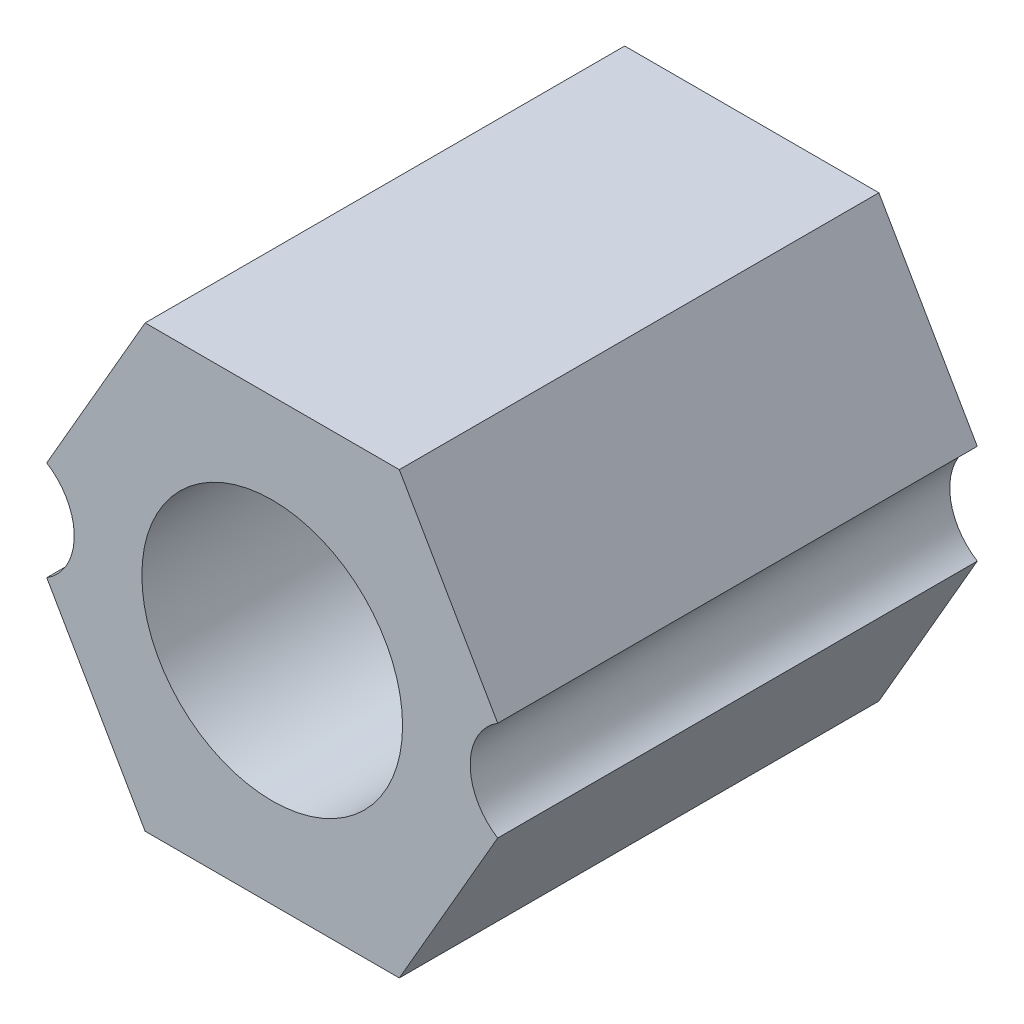
ISO-10303-21;
HEADER;
FILE_DESCRIPTION(('STEP AP214'),'2;1');
FILE_NAME('part.step','',(''),(''),'','','');
FILE_SCHEMA(('AUTOMOTIVE_DESIGN { 1 0 10303 214 1 1 1 1 }'));
ENDSEC;
DATA;
#1=APPLICATION_CONTEXT('core data for automotive mechanical design processes');
#2=APPLICATION_PROTOCOL_DEFINITION('international standard','automotive_design',2000,#1);
#3=PRODUCT_CONTEXT('',#1,'mechanical');
#4=PRODUCT('Part','Part','',(#3));
#5=PRODUCT_RELATED_PRODUCT_CATEGORY('part','',(#4));
#6=PRODUCT_DEFINITION_FORMATION('','',#4);
#7=PRODUCT_DEFINITION_CONTEXT('part definition',#1,'design');
#8=PRODUCT_DEFINITION('design','',#6,#7);
#9=PRODUCT_DEFINITION_SHAPE('','',#8);
#10=(LENGTH_UNIT() NAMED_UNIT(*) SI_UNIT(.MILLI.,.METRE.));
#11=(NAMED_UNIT(*) PLANE_ANGLE_UNIT() SI_UNIT($,.RADIAN.));
#12=(NAMED_UNIT(*) SI_UNIT($,.STERADIAN.) SOLID_ANGLE_UNIT());
#13=UNCERTAINTY_MEASURE_WITH_UNIT(LENGTH_MEASURE(1.E-05),#10,'distance_accuracy_value','');
#14=(GEOMETRIC_REPRESENTATION_CONTEXT(3) GLOBAL_UNCERTAINTY_ASSIGNED_CONTEXT((#13)) GLOBAL_UNIT_ASSIGNED_CONTEXT((#10,
#11,#12)) REPRESENTATION_CONTEXT('',''));
#15=CARTESIAN_POINT('',(0.,0.,0.));
#16=DIRECTION('',(0.,0.,1.));
#17=DIRECTION('',(1.,0.,0.));
#18=AXIS2_PLACEMENT_3D('',#15,#16,#17);
#19=CARTESIAN_POINT('',(0.,0.,3.28359596933378));
#20=DIRECTION('',(0.,0.,1.));
#21=DIRECTION('',(1.,0.,0.));
#22=AXIS2_PLACEMENT_3D('',#19,#20,#21);
#23=PLANE('',#22);
#24=CARTESIAN_POINT('',(0.,0.,3.28359596933378));
#25=DIRECTION('',(0.,0.,1.));
#26=DIRECTION('',(1.,0.,0.));
#27=AXIS2_PLACEMENT_3D('',#24,#25,#26);
#28=CIRCLE('',#27,4.);
#29=CARTESIAN_POINT('',(4.,0.,3.28359596933378));
#30=VERTEX_POINT('',#29);
#31=EDGE_CURVE('E164',#30,#30,#28,.F.);
#32=ORIENTED_EDGE('',*,*,#31,.F.);
#33=EDGE_LOOP('',(#32));
#34=FACE_BOUND('',#33,.T.);
#35=DIRECTION('',(-0.5,-0.866025403784439,0.));
#36=VECTOR('',#35,1.);
#37=CARTESIAN_POINT('',(-5.85,3.37749907475931,3.28359596933378));
#38=LINE('',#37,#36);
#39=CARTESIAN_POINT('',(-3.9,6.75499814951862,3.28359596933378));
#40=VERTEX_POINT('',#39);
#41=CARTESIAN_POINT('',(-6.91933612835916,1.52535457007226,3.28359596933378));
#42=VERTEX_POINT('',#41);
#43=EDGE_CURVE('E133',#40,#42,#38,.T.);
#44=ORIENTED_EDGE('',*,*,#43,.F.);
#45=DIRECTION('',(-1.,0.,0.));
#46=VECTOR('',#45,1.);
#47=CARTESIAN_POINT('',(0.,6.75499814951862,3.28359596933378));
#48=LINE('',#47,#46);
#49=CARTESIAN_POINT('',(3.9,6.75499814951862,3.28359596933378));
#50=VERTEX_POINT('',#49);
#51=EDGE_CURVE('E120',#50,#40,#48,.T.);
#52=ORIENTED_EDGE('',*,*,#51,.F.);
#53=DIRECTION('',(-0.5,0.866025403784439,0.));
#54=VECTOR('',#53,1.);
#55=CARTESIAN_POINT('',(5.85,3.37749907475931,3.28359596933378));
#56=LINE('',#55,#54);
#57=CARTESIAN_POINT('',(6.91933612835911,1.52535457007234,3.28359596933378));
#58=VERTEX_POINT('',#57);
#59=EDGE_CURVE('E126',#58,#50,#56,.T.);
#60=ORIENTED_EDGE('',*,*,#59,.F.);
#61=CARTESIAN_POINT('',(7.875,0.,3.28359596933378));
#62=DIRECTION('',(0.,0.,1.));
#63=DIRECTION('',(1.,0.,0.));
#64=AXIS2_PLACEMENT_3D('',#61,#62,#63);
#65=CIRCLE('',#64,1.8);
#66=CARTESIAN_POINT('',(6.91933612835918,-1.52535457007222,3.28359596933378));
#67=VERTEX_POINT('',#66);
#68=EDGE_CURVE('E124',#58,#67,#65,.T.);
#69=ORIENTED_EDGE('',*,*,#68,.T.);
#70=DIRECTION('',(0.5,0.866025403784439,0.));
#71=VECTOR('',#70,1.);
#72=CARTESIAN_POINT('',(5.85,-3.37749907475931,3.28359596933378));
#73=LINE('',#72,#71);
#74=CARTESIAN_POINT('',(3.9,-6.75499814951862,3.28359596933378));
#75=VERTEX_POINT('',#74);
#76=EDGE_CURVE('E103',#75,#67,#73,.T.);
#77=ORIENTED_EDGE('',*,*,#76,.F.);
#78=DIRECTION('',(1.,0.,0.));
#79=VECTOR('',#78,1.);
#80=CARTESIAN_POINT('',(0.,-6.75499814951862,3.28359596933378));
#81=LINE('',#80,#79);
#82=CARTESIAN_POINT('',(-3.9,-6.75499814951862,3.28359596933378));
#83=VERTEX_POINT('',#82);
#84=EDGE_CURVE('E112',#83,#75,#81,.T.);
#85=ORIENTED_EDGE('',*,*,#84,.F.);
#86=DIRECTION('',(0.5,-0.866025403784439,0.));
#87=VECTOR('',#86,1.);
#88=CARTESIAN_POINT('',(-5.85,-3.37749907475931,3.28359596933378));
#89=LINE('',#88,#87);
#90=CARTESIAN_POINT('',(-6.91933612835913,-1.52535457007231,3.28359596933378));
#91=VERTEX_POINT('',#90);
#92=EDGE_CURVE('E138',#91,#83,#89,.T.);
#93=ORIENTED_EDGE('',*,*,#92,.F.);
#94=CARTESIAN_POINT('',(-7.875,0.,3.28359596933378));
#95=DIRECTION('',(0.,0.,1.));
#96=DIRECTION('',(1.,0.,0.));
#97=AXIS2_PLACEMENT_3D('',#94,#95,#96);
#98=CIRCLE('',#97,1.8);
#99=EDGE_CURVE('E150',#91,#42,#98,.T.);
#100=ORIENTED_EDGE('',*,*,#99,.T.);
#101=EDGE_LOOP('',(#44,#52,#60,#69,#77,#85,#93,#100));
#102=FACE_BOUND('',#101,.T.);
#103=ADVANCED_FACE('F37',(#34,#102),#23,.F.);
#104=CARTESIAN_POINT('',(-7.875,0.,18.));
#105=DIRECTION('',(0.,0.,-1.));
#106=DIRECTION('',(-1.,0.,0.));
#107=AXIS2_PLACEMENT_3D('',#104,#105,#106);
#108=CYLINDRICAL_SURFACE('',#107,1.8);
#109=ORIENTED_EDGE('',*,*,#99,.F.);
#110=DIRECTION('',(0.,0.,-1.));
#111=VECTOR('',#110,1.);
#112=CARTESIAN_POINT('',(-6.91933612835913,-1.52535457007231,18.));
#113=LINE('',#112,#111);
#114=CARTESIAN_POINT('',(-6.91933612835913,-1.52535457007231,18.));
#115=VERTEX_POINT('',#114);
#116=EDGE_CURVE('E58',#115,#91,#113,.T.);
#117=ORIENTED_EDGE('',*,*,#116,.F.);
#118=CARTESIAN_POINT('',(-7.875,0.,18.));
#119=DIRECTION('',(0.,0.,-1.));
#120=DIRECTION('',(-1.,0.,0.));
#121=AXIS2_PLACEMENT_3D('',#118,#119,#120);
#122=CIRCLE('',#121,1.8);
#123=CARTESIAN_POINT('',(-6.91933612835915,1.52535457007226,18.));
#124=VERTEX_POINT('',#123);
#125=EDGE_CURVE('E119',#124,#115,#122,.T.);
#126=ORIENTED_EDGE('',*,*,#125,.F.);
#127=DIRECTION('',(0.,0.,-1.));
#128=VECTOR('',#127,1.);
#129=CARTESIAN_POINT('',(-6.91933612835915,1.52535457007226,18.));
#130=LINE('',#129,#128);
#131=EDGE_CURVE('E147',#42,#124,#130,.F.);
#132=ORIENTED_EDGE('',*,*,#131,.F.);
#133=EDGE_LOOP('',(#109,#117,#126,#132));
#134=FACE_BOUND('',#133,.T.);
#135=ADVANCED_FACE('F205',(#134),#108,.F.);
#136=CARTESIAN_POINT('',(7.875,0.,18.));
#137=DIRECTION('',(0.,0.,-1.));
#138=DIRECTION('',(-1.,0.,0.));
#139=AXIS2_PLACEMENT_3D('',#136,#137,#138);
#140=CYLINDRICAL_SURFACE('',#139,1.8);
#141=ORIENTED_EDGE('',*,*,#68,.F.);
#142=DIRECTION('',(0.,0.,-1.));
#143=VECTOR('',#142,1.);
#144=CARTESIAN_POINT('',(6.91933612835911,1.52535457007234,18.));
#145=LINE('',#144,#143);
#146=CARTESIAN_POINT('',(6.91933612835911,1.52535457007234,18.));
#147=VERTEX_POINT('',#146);
#148=EDGE_CURVE('E154',#147,#58,#145,.T.);
#149=ORIENTED_EDGE('',*,*,#148,.F.);
#150=CARTESIAN_POINT('',(7.875,0.,18.));
#151=DIRECTION('',(0.,0.,1.));
#152=DIRECTION('',(1.,0.,0.));
#153=AXIS2_PLACEMENT_3D('',#150,#151,#152);
#154=CIRCLE('',#153,1.8);
#155=CARTESIAN_POINT('',(6.91933612835918,-1.52535457007222,18.));
#156=VERTEX_POINT('',#155);
#157=EDGE_CURVE('E12',#147,#156,#154,.T.);
#158=ORIENTED_EDGE('',*,*,#157,.T.);
#159=DIRECTION('',(0.,0.,-1.));
#160=VECTOR('',#159,1.);
#161=CARTESIAN_POINT('',(6.91933612835918,-1.52535457007222,18.));
#162=LINE('',#161,#160);
#163=EDGE_CURVE('E50',#67,#156,#162,.F.);
#164=ORIENTED_EDGE('',*,*,#163,.F.);
#165=EDGE_LOOP('',(#141,#149,#158,#164));
#166=FACE_BOUND('',#165,.T.);
#167=ADVANCED_FACE('F203',(#166),#140,.F.);
#168=CARTESIAN_POINT('',(-3.9,-6.75499814951862,18.));
#169=DIRECTION('',(0.,1.,0.));
#170=DIRECTION('',(0.,0.,1.));
#171=AXIS2_PLACEMENT_3D('',#168,#169,#170);
#172=PLANE('',#171);
#173=DIRECTION('',(0.,0.,-1.));
#174=VECTOR('',#173,1.);
#175=CARTESIAN_POINT('',(-3.9,-6.75499814951862,18.));
#176=LINE('',#175,#174);
#177=CARTESIAN_POINT('',(-3.9,-6.75499814951862,18.));
#178=VERTEX_POINT('',#177);
#179=EDGE_CURVE('E115',#178,#83,#176,.T.);
#180=ORIENTED_EDGE('',*,*,#179,.T.);
#181=ORIENTED_EDGE('',*,*,#84,.T.);
#182=DIRECTION('',(0.,0.,-1.));
#183=VECTOR('',#182,1.);
#184=CARTESIAN_POINT('',(3.9,-6.75499814951862,18.));
#185=LINE('',#184,#183);
#186=CARTESIAN_POINT('',(3.9,-6.75499814951862,18.));
#187=VERTEX_POINT('',#186);
#188=EDGE_CURVE('E44',#187,#75,#185,.T.);
#189=ORIENTED_EDGE('',*,*,#188,.F.);
#190=DIRECTION('',(1.,0.,0.));
#191=VECTOR('',#190,1.);
#192=CARTESIAN_POINT('',(-3.9,-6.75499814951862,18.));
#193=LINE('',#192,#191);
#194=EDGE_CURVE('E168',#178,#187,#193,.T.);
#195=ORIENTED_EDGE('',*,*,#194,.F.);
#196=EDGE_LOOP('',(#180,#181,#189,#195));
#197=FACE_BOUND('',#196,.T.);
#198=ADVANCED_FACE('F113',(#197),#172,.F.);
#199=CARTESIAN_POINT('',(3.9,-6.75499814951862,18.));
#200=DIRECTION('',(-0.866025403784439,0.5,0.));
#201=DIRECTION('',(-0.5,-0.866025403784439,0.));
#202=AXIS2_PLACEMENT_3D('',#199,#200,#201);
#203=PLANE('',#202);
#204=ORIENTED_EDGE('',*,*,#188,.T.);
#205=ORIENTED_EDGE('',*,*,#76,.T.);
#206=ORIENTED_EDGE('',*,*,#163,.T.);
#207=DIRECTION('',(0.5,0.866025403784439,0.));
#208=VECTOR('',#207,1.);
#209=CARTESIAN_POINT('',(3.9,-6.75499814951862,18.));
#210=LINE('',#209,#208);
#211=EDGE_CURVE('E106',#187,#156,#210,.T.);
#212=ORIENTED_EDGE('',*,*,#211,.F.);
#213=EDGE_LOOP('',(#204,#205,#206,#212));
#214=FACE_BOUND('',#213,.T.);
#215=ADVANCED_FACE('F101',(#214),#203,.F.);
#216=CARTESIAN_POINT('',(7.8,0.,18.));
#217=DIRECTION('',(-0.866025403784439,-0.5,0.));
#218=DIRECTION('',(0.5,-0.866025403784439,0.));
#219=AXIS2_PLACEMENT_3D('',#216,#217,#218);
#220=PLANE('',#219);
#221=DIRECTION('',(-0.5,0.866025403784438,0.));
#222=VECTOR('',#221,1.);
#223=CARTESIAN_POINT('',(7.8,0.,18.));
#224=LINE('',#223,#222);
#225=CARTESIAN_POINT('',(3.9,6.75499814951862,18.));
#226=VERTEX_POINT('',#225);
#227=EDGE_CURVE('E171',#147,#226,#224,.T.);
#228=ORIENTED_EDGE('',*,*,#227,.F.);
#229=ORIENTED_EDGE('',*,*,#148,.T.);
#230=ORIENTED_EDGE('',*,*,#59,.T.);
#231=DIRECTION('',(0.,0.,-1.));
#232=VECTOR('',#231,1.);
#233=CARTESIAN_POINT('',(3.9,6.75499814951862,18.));
#234=LINE('',#233,#232);
#235=EDGE_CURVE('E110',#226,#50,#234,.T.);
#236=ORIENTED_EDGE('',*,*,#235,.F.);
#237=EDGE_LOOP('',(#228,#229,#230,#236));
#238=FACE_BOUND('',#237,.T.);
#239=ADVANCED_FACE('F194',(#238),#220,.F.);
#240=CARTESIAN_POINT('',(3.9,6.75499814951862,18.));
#241=DIRECTION('',(0.,-1.,0.));
#242=DIRECTION('',(1.,0.,0.));
#243=AXIS2_PLACEMENT_3D('',#240,#241,#242);
#244=PLANE('',#243);
#245=ORIENTED_EDGE('',*,*,#235,.T.);
#246=ORIENTED_EDGE('',*,*,#51,.T.);
#247=DIRECTION('',(0.,0.,-1.));
#248=VECTOR('',#247,1.);
#249=CARTESIAN_POINT('',(-3.9,6.75499814951862,18.));
#250=LINE('',#249,#248);
#251=CARTESIAN_POINT('',(-3.9,6.75499814951862,18.));
#252=VERTEX_POINT('',#251);
#253=EDGE_CURVE('E182',#252,#40,#250,.T.);
#254=ORIENTED_EDGE('',*,*,#253,.F.);
#255=DIRECTION('',(-1.,0.,0.));
#256=VECTOR('',#255,1.);
#257=CARTESIAN_POINT('',(3.9,6.75499814951862,18.));
#258=LINE('',#257,#256);
#259=EDGE_CURVE('E173',#226,#252,#258,.T.);
#260=ORIENTED_EDGE('',*,*,#259,.F.);
#261=EDGE_LOOP('',(#245,#246,#254,#260));
#262=FACE_BOUND('',#261,.T.);
#263=ADVANCED_FACE('F189',(#262),#244,.F.);
#264=CARTESIAN_POINT('',(-3.9,6.75499814951862,18.));
#265=DIRECTION('',(0.866025403784439,-0.5,0.));
#266=DIRECTION('',(0.5,0.866025403784439,0.));
#267=AXIS2_PLACEMENT_3D('',#264,#265,#266);
#268=PLANE('',#267);
#269=ORIENTED_EDGE('',*,*,#253,.T.);
#270=ORIENTED_EDGE('',*,*,#43,.T.);
#271=ORIENTED_EDGE('',*,*,#131,.T.);
#272=DIRECTION('',(-0.5,-0.866025403784439,0.));
#273=VECTOR('',#272,1.);
#274=CARTESIAN_POINT('',(-3.9,6.75499814951862,18.));
#275=LINE('',#274,#273);
#276=EDGE_CURVE('E175',#252,#124,#275,.T.);
#277=ORIENTED_EDGE('',*,*,#276,.F.);
#278=EDGE_LOOP('',(#269,#270,#271,#277));
#279=FACE_BOUND('',#278,.T.);
#280=ADVANCED_FACE('F196',(#279),#268,.F.);
#281=CARTESIAN_POINT('',(-7.8,0.,18.));
#282=DIRECTION('',(0.866025403784438,0.5,0.));
#283=DIRECTION('',(-0.5,0.866025403784439,0.));
#284=AXIS2_PLACEMENT_3D('',#281,#282,#283);
#285=PLANE('',#284);
#286=DIRECTION('',(0.5,-0.866025403784438,0.));
#287=VECTOR('',#286,1.);
#288=CARTESIAN_POINT('',(-7.8,0.,18.));
#289=LINE('',#288,#287);
#290=EDGE_CURVE('E179',#115,#178,#289,.T.);
#291=ORIENTED_EDGE('',*,*,#290,.F.);
#292=ORIENTED_EDGE('',*,*,#116,.T.);
#293=ORIENTED_EDGE('',*,*,#92,.T.);
#294=ORIENTED_EDGE('',*,*,#179,.F.);
#295=EDGE_LOOP('',(#291,#292,#293,#294));
#296=FACE_BOUND('',#295,.T.);
#297=ADVANCED_FACE('F225',(#296),#285,.F.);
#298=CARTESIAN_POINT('',(0.,0.,18.));
#299=DIRECTION('',(0.,0.,1.));
#300=DIRECTION('',(1.,0.,0.));
#301=AXIS2_PLACEMENT_3D('',#298,#299,#300);
#302=PLANE('',#301);
#303=ORIENTED_EDGE('',*,*,#157,.F.);
#304=ORIENTED_EDGE('',*,*,#227,.T.);
#305=ORIENTED_EDGE('',*,*,#259,.T.);
#306=ORIENTED_EDGE('',*,*,#276,.T.);
#307=ORIENTED_EDGE('',*,*,#125,.T.);
#308=ORIENTED_EDGE('',*,*,#290,.T.);
#309=ORIENTED_EDGE('',*,*,#194,.T.);
#310=ORIENTED_EDGE('',*,*,#211,.T.);
#311=EDGE_LOOP('',(#303,#304,#305,#306,#307,#308,#309,#310));
#312=FACE_BOUND('',#311,.T.);
#313=CARTESIAN_POINT('',(0.,0.,18.));
#314=DIRECTION('',(0.,0.,1.));
#315=DIRECTION('',(1.,0.,0.));
#316=AXIS2_PLACEMENT_3D('',#313,#314,#315);
#317=CIRCLE('',#316,4.);
#318=CARTESIAN_POINT('',(4.,0.,18.));
#319=VERTEX_POINT('',#318);
#320=EDGE_CURVE('E160',#319,#319,#317,.T.);
#321=ORIENTED_EDGE('',*,*,#320,.F.);
#322=EDGE_LOOP('',(#321));
#323=FACE_BOUND('',#322,.T.);
#324=ADVANCED_FACE('F200',(#312,#323),#302,.T.);
#325=CARTESIAN_POINT('',(0.,0.,18.));
#326=DIRECTION('',(0.,0.,-1.));
#327=DIRECTION('',(-1.,0.,0.));
#328=AXIS2_PLACEMENT_3D('',#325,#326,#327);
#329=CYLINDRICAL_SURFACE('',#328,4.);
#330=ORIENTED_EDGE('',*,*,#320,.T.);
#331=EDGE_LOOP('',(#330));
#332=FACE_BOUND('',#331,.T.);
#333=ORIENTED_EDGE('',*,*,#31,.T.);
#334=EDGE_LOOP('',(#333));
#335=FACE_BOUND('',#334,.T.);
#336=ADVANCED_FACE('F218',(#332,#335),#329,.F.);
#337=CLOSED_SHELL('',(#103,#135,#167,#198,#215,#239,#263,#280,#297,#324,#336));
#338=MANIFOLD_SOLID_BREP('B2',#337);
#339=ADVANCED_BREP_SHAPE_REPRESENTATION('',(#18,#338),#14);
#340=SHAPE_DEFINITION_REPRESENTATION(#9,#339);
ENDSEC;
END-ISO-10303-21;
